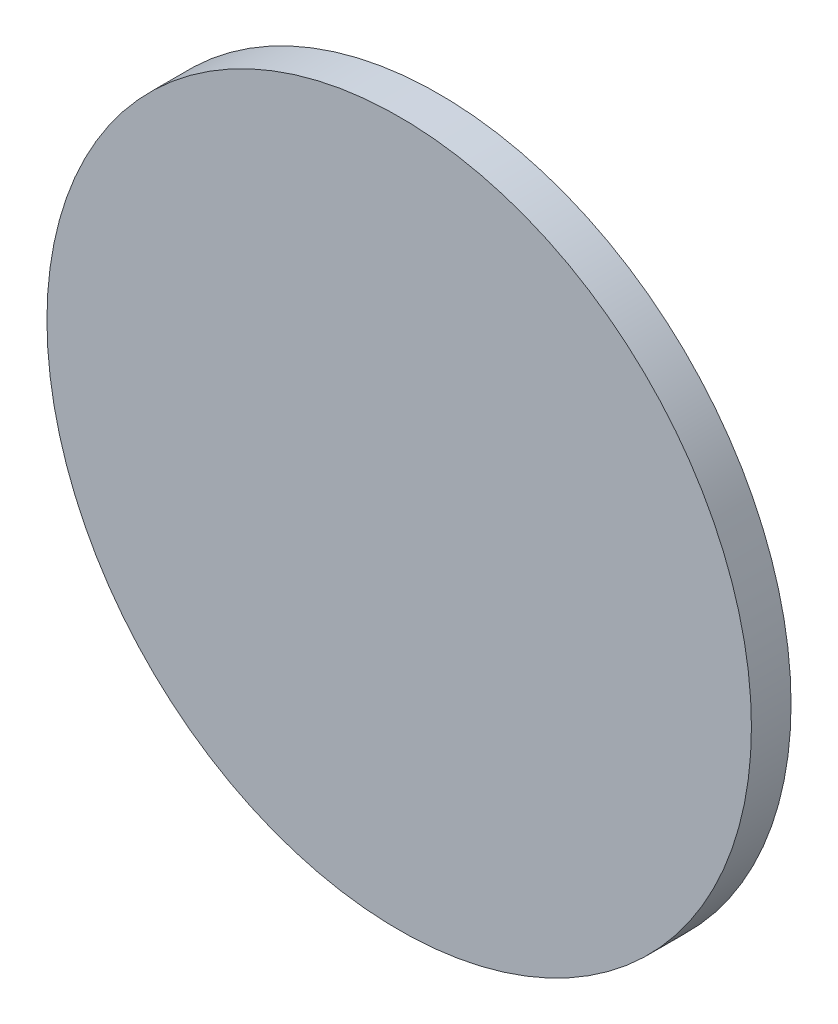
ISO-10303-21;
HEADER;
FILE_DESCRIPTION(('STEP AP214'),'2;1');
FILE_NAME('part.step','',(''),(''),'','','');
FILE_SCHEMA(('AUTOMOTIVE_DESIGN { 1 0 10303 214 1 1 1 1 }'));
ENDSEC;
DATA;
#1=APPLICATION_CONTEXT('core data for automotive mechanical design processes');
#2=APPLICATION_PROTOCOL_DEFINITION('international standard','automotive_design',2000,#1);
#3=PRODUCT_CONTEXT('',#1,'mechanical');
#4=PRODUCT('Part','Part','',(#3));
#5=PRODUCT_RELATED_PRODUCT_CATEGORY('part','',(#4));
#6=PRODUCT_DEFINITION_FORMATION('','',#4);
#7=PRODUCT_DEFINITION_CONTEXT('part definition',#1,'design');
#8=PRODUCT_DEFINITION('design','',#6,#7);
#9=PRODUCT_DEFINITION_SHAPE('','',#8);
#10=(LENGTH_UNIT() NAMED_UNIT(*) SI_UNIT(.MILLI.,.METRE.));
#11=(NAMED_UNIT(*) PLANE_ANGLE_UNIT() SI_UNIT($,.RADIAN.));
#12=(NAMED_UNIT(*) SI_UNIT($,.STERADIAN.) SOLID_ANGLE_UNIT());
#13=UNCERTAINTY_MEASURE_WITH_UNIT(LENGTH_MEASURE(1.E-05),#10,'distance_accuracy_value','');
#14=(GEOMETRIC_REPRESENTATION_CONTEXT(3) GLOBAL_UNCERTAINTY_ASSIGNED_CONTEXT((#13)) GLOBAL_UNIT_ASSIGNED_CONTEXT((#10,
#11,#12)) REPRESENTATION_CONTEXT('',''));
#15=CARTESIAN_POINT('',(0.,0.,0.));
#16=DIRECTION('',(0.,0.,1.));
#17=DIRECTION('',(1.,0.,0.));
#18=AXIS2_PLACEMENT_3D('',#15,#16,#17);
#19=CARTESIAN_POINT('',(8.34916,16.034908666667,0.76487));
#20=DIRECTION('',(0.,0.,-1.));
#21=DIRECTION('',(-1.,0.,0.));
#22=AXIS2_PLACEMENT_3D('',#19,#20,#21);
#23=PLANE('',#22);
#24=CARTESIAN_POINT('',(8.34916,16.034908666667,0.76487));
#25=DIRECTION('',(0.,0.,1.));
#26=DIRECTION('',(1.,0.,0.));
#27=AXIS2_PLACEMENT_3D('',#24,#25,#26);
#28=CIRCLE('',#27,0.1524);
#29=CARTESIAN_POINT('',(8.50156,16.034908666667,0.76487));
#30=VERTEX_POINT('',#29);
#31=EDGE_CURVE('E18',#30,#30,#28,.T.);
#32=ORIENTED_EDGE('',*,*,#31,.F.);
#33=EDGE_LOOP('',(#32));
#34=FACE_BOUND('',#33,.T.);
#35=ADVANCED_FACE('F15',(#34),#23,.T.);
#36=CARTESIAN_POINT('',(8.34916,16.034908666667,0.76487));
#37=DIRECTION('',(0.,0.,1.));
#38=DIRECTION('',(1.,0.,0.));
#39=AXIS2_PLACEMENT_3D('',#36,#37,#38);
#40=CYLINDRICAL_SURFACE('',#39,0.1524);
#41=CARTESIAN_POINT('',(8.34916,16.034908666667,0.782015));
#42=DIRECTION('',(0.,0.,1.));
#43=DIRECTION('',(1.,0.,0.));
#44=AXIS2_PLACEMENT_3D('',#41,#42,#43);
#45=CIRCLE('',#44,0.1524);
#46=CARTESIAN_POINT('',(8.50156,16.034908666667,0.782015));
#47=VERTEX_POINT('',#46);
#48=EDGE_CURVE('E10',#47,#47,#45,.T.);
#49=ORIENTED_EDGE('',*,*,#48,.F.);
#50=EDGE_LOOP('',(#49));
#51=FACE_BOUND('',#50,.T.);
#52=ORIENTED_EDGE('',*,*,#31,.T.);
#53=EDGE_LOOP('',(#52));
#54=FACE_BOUND('',#53,.T.);
#55=ADVANCED_FACE('F27',(#51,#54),#40,.T.);
#56=CARTESIAN_POINT('',(8.34916,16.034908666667,0.782015));
#57=DIRECTION('',(0.,0.,1.));
#58=DIRECTION('',(1.,0.,0.));
#59=AXIS2_PLACEMENT_3D('',#56,#57,#58);
#60=PLANE('',#59);
#61=ORIENTED_EDGE('',*,*,#48,.T.);
#62=EDGE_LOOP('',(#61));
#63=FACE_BOUND('',#62,.T.);
#64=ADVANCED_FACE('F34',(#63),#60,.T.);
#65=CLOSED_SHELL('',(#35,#55,#64));
#66=MANIFOLD_SOLID_BREP('B1',#65);
#67=ADVANCED_BREP_SHAPE_REPRESENTATION('',(#18,#66),#14);
#68=SHAPE_DEFINITION_REPRESENTATION(#9,#67);
ENDSEC;
END-ISO-10303-21;
